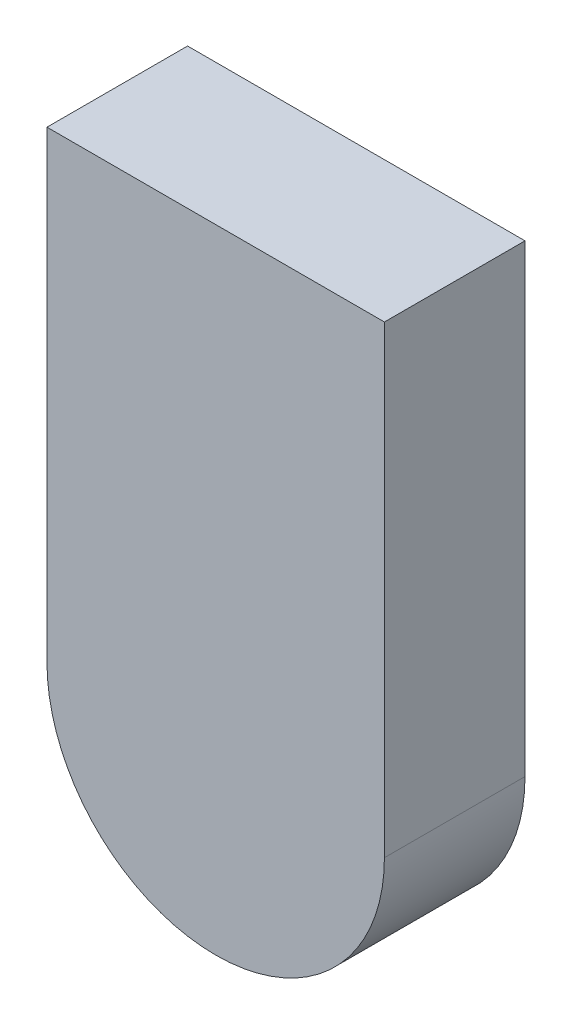
ISO-10303-21;
HEADER;
FILE_DESCRIPTION(('STEP AP214'),'2;1');
FILE_NAME('part.step','',(''),(''),'','','');
FILE_SCHEMA(('AUTOMOTIVE_DESIGN { 1 0 10303 214 1 1 1 1 }'));
ENDSEC;
DATA;
#1=APPLICATION_CONTEXT('core data for automotive mechanical design processes');
#2=APPLICATION_PROTOCOL_DEFINITION('international standard','automotive_design',2000,#1);
#3=PRODUCT_CONTEXT('',#1,'mechanical');
#4=PRODUCT('Part','Part','',(#3));
#5=PRODUCT_RELATED_PRODUCT_CATEGORY('part','',(#4));
#6=PRODUCT_DEFINITION_FORMATION('','',#4);
#7=PRODUCT_DEFINITION_CONTEXT('part definition',#1,'design');
#8=PRODUCT_DEFINITION('design','',#6,#7);
#9=PRODUCT_DEFINITION_SHAPE('','',#8);
#10=(LENGTH_UNIT() NAMED_UNIT(*) SI_UNIT(.MILLI.,.METRE.));
#11=(NAMED_UNIT(*) PLANE_ANGLE_UNIT() SI_UNIT($,.RADIAN.));
#12=(NAMED_UNIT(*) SI_UNIT($,.STERADIAN.) SOLID_ANGLE_UNIT());
#13=UNCERTAINTY_MEASURE_WITH_UNIT(LENGTH_MEASURE(1.E-05),#10,'distance_accuracy_value','');
#14=(GEOMETRIC_REPRESENTATION_CONTEXT(3) GLOBAL_UNCERTAINTY_ASSIGNED_CONTEXT((#13)) GLOBAL_UNIT_ASSIGNED_CONTEXT((#10,
#11,#12)) REPRESENTATION_CONTEXT('',''));
#15=CARTESIAN_POINT('',(0.,0.,0.));
#16=DIRECTION('',(0.,0.,1.));
#17=DIRECTION('',(1.,0.,0.));
#18=AXIS2_PLACEMENT_3D('',#15,#16,#17);
#19=CARTESIAN_POINT('',(2.63,4.05,0.));
#20=DIRECTION('',(0.,1.,0.));
#21=DIRECTION('',(1.,0.,0.));
#22=AXIS2_PLACEMENT_3D('',#19,#20,#21);
#23=PLANE('',#22);
#24=DIRECTION('',(0.,0.,1.));
#25=VECTOR('',#24,1.);
#26=CARTESIAN_POINT('',(2.63,4.05,0.));
#27=LINE('',#26,#25);
#28=CARTESIAN_POINT('',(2.63,4.05,0.));
#29=VERTEX_POINT('',#28);
#30=CARTESIAN_POINT('',(2.63,4.05,0.1));
#31=VERTEX_POINT('',#30);
#32=EDGE_CURVE('E11',#29,#31,#27,.T.);
#33=ORIENTED_EDGE('',*,*,#32,.T.);
#34=DIRECTION('',(1.,0.,0.));
#35=VECTOR('',#34,1.);
#36=CARTESIAN_POINT('',(2.63,4.05,0.1));
#37=LINE('',#36,#35);
#38=CARTESIAN_POINT('',(2.87,4.05,0.1));
#39=VERTEX_POINT('',#38);
#40=EDGE_CURVE('E24',#31,#39,#37,.T.);
#41=ORIENTED_EDGE('',*,*,#40,.T.);
#42=DIRECTION('',(0.,0.,1.));
#43=VECTOR('',#42,1.);
#44=CARTESIAN_POINT('',(2.87,4.05,0.));
#45=LINE('',#44,#43);
#46=CARTESIAN_POINT('',(2.87,4.05,0.));
#47=VERTEX_POINT('',#46);
#48=EDGE_CURVE('E85',#47,#39,#45,.T.);
#49=ORIENTED_EDGE('',*,*,#48,.F.);
#50=DIRECTION('',(1.,0.,0.));
#51=VECTOR('',#50,1.);
#52=CARTESIAN_POINT('',(2.63,4.05,0.));
#53=LINE('',#52,#51);
#54=EDGE_CURVE('E82',#29,#47,#53,.T.);
#55=ORIENTED_EDGE('',*,*,#54,.F.);
#56=EDGE_LOOP('',(#33,#41,#49,#55));
#57=FACE_BOUND('',#56,.T.);
#58=ADVANCED_FACE('F17',(#57),#23,.T.);
#59=CARTESIAN_POINT('',(2.87,4.05,0.));
#60=DIRECTION('',(1.,0.,0.));
#61=DIRECTION('',(0.,-1.,0.));
#62=AXIS2_PLACEMENT_3D('',#59,#60,#61);
#63=PLANE('',#62);
#64=ORIENTED_EDGE('',*,*,#48,.T.);
#65=DIRECTION('',(0.,-1.,0.));
#66=VECTOR('',#65,1.);
#67=CARTESIAN_POINT('',(2.87,4.05,0.1));
#68=LINE('',#67,#66);
#69=CARTESIAN_POINT('',(2.87,3.72,0.1));
#70=VERTEX_POINT('',#69);
#71=EDGE_CURVE('E80',#39,#70,#68,.T.);
#72=ORIENTED_EDGE('',*,*,#71,.T.);
#73=DIRECTION('',(0.,0.,1.));
#74=VECTOR('',#73,1.);
#75=CARTESIAN_POINT('',(2.87,3.72,0.));
#76=LINE('',#75,#74);
#77=CARTESIAN_POINT('',(2.87,3.72,0.));
#78=VERTEX_POINT('',#77);
#79=EDGE_CURVE('E60',#78,#70,#76,.T.);
#80=ORIENTED_EDGE('',*,*,#79,.F.);
#81=DIRECTION('',(0.,-1.,0.));
#82=VECTOR('',#81,1.);
#83=CARTESIAN_POINT('',(2.87,4.05,0.));
#84=LINE('',#83,#82);
#85=EDGE_CURVE('E76',#47,#78,#84,.T.);
#86=ORIENTED_EDGE('',*,*,#85,.F.);
#87=EDGE_LOOP('',(#64,#72,#80,#86));
#88=FACE_BOUND('',#87,.T.);
#89=ADVANCED_FACE('F89',(#88),#63,.T.);
#90=CARTESIAN_POINT('',(2.75,3.72,0.));
#91=DIRECTION('',(0.,0.,-1.));
#92=DIRECTION('',(1.,0.,0.));
#93=AXIS2_PLACEMENT_3D('',#90,#91,#92);
#94=CYLINDRICAL_SURFACE('',#93,0.12);
#95=CARTESIAN_POINT('',(2.75,3.72,0.));
#96=DIRECTION('',(0.,0.,1.));
#97=DIRECTION('',(1.,0.,0.));
#98=AXIS2_PLACEMENT_3D('',#95,#96,#97);
#99=CIRCLE('',#98,0.12);
#100=CARTESIAN_POINT('',(2.63,3.72,0.));
#101=VERTEX_POINT('',#100);
#102=EDGE_CURVE('E64',#101,#78,#99,.T.);
#103=ORIENTED_EDGE('',*,*,#102,.T.);
#104=ORIENTED_EDGE('',*,*,#79,.T.);
#105=CARTESIAN_POINT('',(2.75,3.72,0.1));
#106=DIRECTION('',(0.,0.,1.));
#107=DIRECTION('',(1.,0.,0.));
#108=AXIS2_PLACEMENT_3D('',#105,#106,#107);
#109=CIRCLE('',#108,0.12);
#110=CARTESIAN_POINT('',(2.63,3.72,0.1));
#111=VERTEX_POINT('',#110);
#112=EDGE_CURVE('E55',#111,#70,#109,.T.);
#113=ORIENTED_EDGE('',*,*,#112,.F.);
#114=DIRECTION('',(0.,0.,1.));
#115=VECTOR('',#114,1.);
#116=CARTESIAN_POINT('',(2.63,3.72,0.));
#117=LINE('',#116,#115);
#118=EDGE_CURVE('E59',#101,#111,#117,.T.);
#119=ORIENTED_EDGE('',*,*,#118,.F.);
#120=EDGE_LOOP('',(#103,#104,#113,#119));
#121=FACE_BOUND('',#120,.T.);
#122=ADVANCED_FACE('F58',(#121),#94,.T.);
#123=CARTESIAN_POINT('',(2.63,4.05,0.));
#124=DIRECTION('',(1.,0.,0.));
#125=DIRECTION('',(0.,-1.,0.));
#126=AXIS2_PLACEMENT_3D('',#123,#124,#125);
#127=PLANE('',#126);
#128=DIRECTION('',(0.,-1.,0.));
#129=VECTOR('',#128,1.);
#130=CARTESIAN_POINT('',(2.63,4.05,0.));
#131=LINE('',#130,#129);
#132=EDGE_CURVE('E69',#29,#101,#131,.T.);
#133=ORIENTED_EDGE('',*,*,#132,.T.);
#134=ORIENTED_EDGE('',*,*,#118,.T.);
#135=DIRECTION('',(0.,-1.,0.));
#136=VECTOR('',#135,1.);
#137=CARTESIAN_POINT('',(2.63,4.05,0.1));
#138=LINE('',#137,#136);
#139=EDGE_CURVE('E67',#31,#111,#138,.T.);
#140=ORIENTED_EDGE('',*,*,#139,.F.);
#141=ORIENTED_EDGE('',*,*,#32,.F.);
#142=EDGE_LOOP('',(#133,#134,#140,#141));
#143=FACE_BOUND('',#142,.T.);
#144=ADVANCED_FACE('F66',(#143),#127,.F.);
#145=CARTESIAN_POINT('',(2.75,3.849490847913,0.));
#146=DIRECTION('',(0.,0.,-1.));
#147=DIRECTION('',(-1.,0.,0.));
#148=AXIS2_PLACEMENT_3D('',#145,#146,#147);
#149=PLANE('',#148);
#150=ORIENTED_EDGE('',*,*,#54,.T.);
#151=ORIENTED_EDGE('',*,*,#85,.T.);
#152=ORIENTED_EDGE('',*,*,#102,.F.);
#153=ORIENTED_EDGE('',*,*,#132,.F.);
#154=EDGE_LOOP('',(#150,#151,#152,#153));
#155=FACE_BOUND('',#154,.T.);
#156=ADVANCED_FACE('F91',(#155),#149,.T.);
#157=CARTESIAN_POINT('',(2.75,3.849490847913,0.1));
#158=DIRECTION('',(0.,0.,-1.));
#159=DIRECTION('',(-1.,0.,0.));
#160=AXIS2_PLACEMENT_3D('',#157,#158,#159);
#161=PLANE('',#160);
#162=ORIENTED_EDGE('',*,*,#139,.T.);
#163=ORIENTED_EDGE('',*,*,#112,.T.);
#164=ORIENTED_EDGE('',*,*,#71,.F.);
#165=ORIENTED_EDGE('',*,*,#40,.F.);
#166=EDGE_LOOP('',(#162,#163,#164,#165));
#167=FACE_BOUND('',#166,.T.);
#168=ADVANCED_FACE('F71',(#167),#161,.F.);
#169=CLOSED_SHELL('',(#58,#89,#122,#144,#156,#168));
#170=MANIFOLD_SOLID_BREP('B1',#169);
#171=ADVANCED_BREP_SHAPE_REPRESENTATION('',(#18,#170),#14);
#172=SHAPE_DEFINITION_REPRESENTATION(#9,#171);
ENDSEC;
END-ISO-10303-21;
